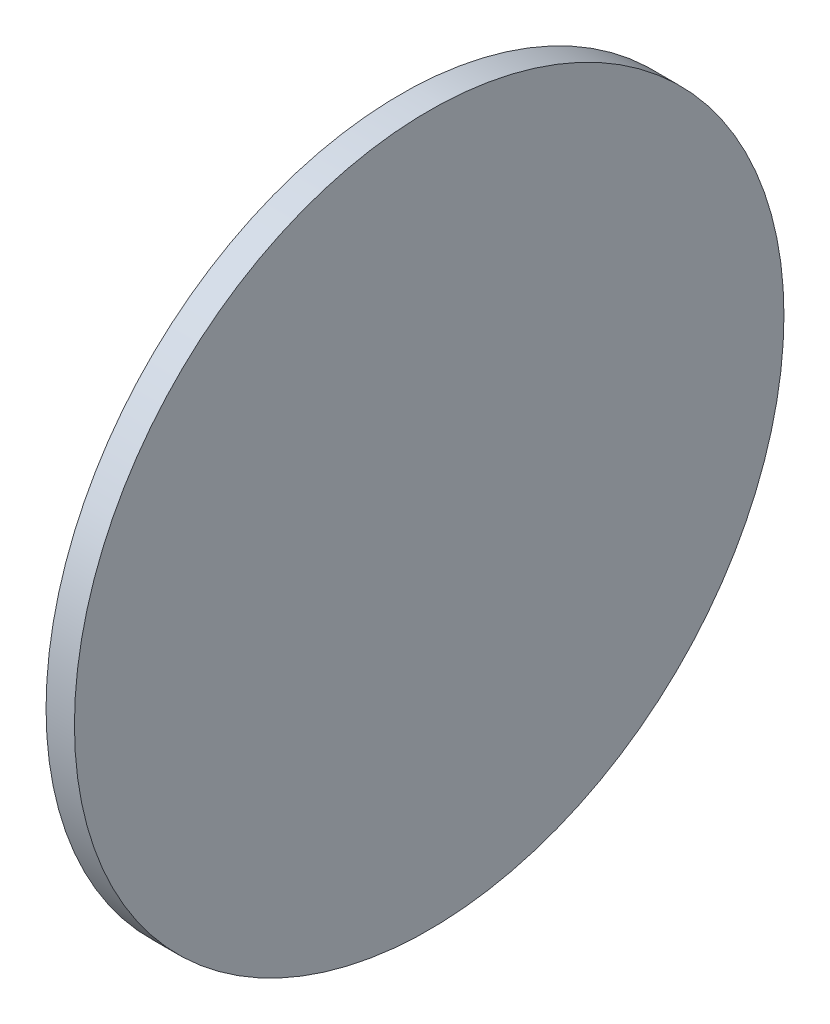
ISO-10303-21;
HEADER;
FILE_DESCRIPTION(('STEP AP214'),'2;1');
FILE_NAME('part.step','',(''),(''),'','','');
FILE_SCHEMA(('AUTOMOTIVE_DESIGN { 1 0 10303 214 1 1 1 1 }'));
ENDSEC;
DATA;
#1=APPLICATION_CONTEXT('core data for automotive mechanical design processes');
#2=APPLICATION_PROTOCOL_DEFINITION('international standard','automotive_design',2000,#1);
#3=PRODUCT_CONTEXT('',#1,'mechanical');
#4=PRODUCT('Part','Part','',(#3));
#5=PRODUCT_RELATED_PRODUCT_CATEGORY('part','',(#4));
#6=PRODUCT_DEFINITION_FORMATION('','',#4);
#7=PRODUCT_DEFINITION_CONTEXT('part definition',#1,'design');
#8=PRODUCT_DEFINITION('design','',#6,#7);
#9=PRODUCT_DEFINITION_SHAPE('','',#8);
#10=(LENGTH_UNIT() NAMED_UNIT(*) SI_UNIT(.MILLI.,.METRE.));
#11=(NAMED_UNIT(*) PLANE_ANGLE_UNIT() SI_UNIT($,.RADIAN.));
#12=(NAMED_UNIT(*) SI_UNIT($,.STERADIAN.) SOLID_ANGLE_UNIT());
#13=UNCERTAINTY_MEASURE_WITH_UNIT(LENGTH_MEASURE(1.E-05),#10,'distance_accuracy_value','');
#14=(GEOMETRIC_REPRESENTATION_CONTEXT(3) GLOBAL_UNCERTAINTY_ASSIGNED_CONTEXT((#13)) GLOBAL_UNIT_ASSIGNED_CONTEXT((#10,
#11,#12)) REPRESENTATION_CONTEXT('',''));
#15=CARTESIAN_POINT('',(0.,0.,0.));
#16=DIRECTION('',(0.,0.,1.));
#17=DIRECTION('',(1.,0.,0.));
#18=AXIS2_PLACEMENT_3D('',#15,#16,#17);
#19=CARTESIAN_POINT('',(0.,0.,0.));
#20=DIRECTION('',(-1.,0.,0.));
#21=DIRECTION('',(0.,0.,1.));
#22=AXIS2_PLACEMENT_3D('',#19,#20,#21);
#23=CYLINDRICAL_SURFACE('',#22,25.);
#24=CARTESIAN_POINT('',(0.,0.,0.));
#25=DIRECTION('',(-1.,0.,0.));
#26=DIRECTION('',(0.,0.,1.));
#27=AXIS2_PLACEMENT_3D('',#24,#25,#26);
#28=CIRCLE('',#27,25.);
#29=CARTESIAN_POINT('',(0.,0.,25.));
#30=VERTEX_POINT('',#29);
#31=EDGE_CURVE('E44',#30,#30,#28,.T.);
#32=ORIENTED_EDGE('',*,*,#31,.F.);
#33=EDGE_LOOP('',(#32));
#34=FACE_BOUND('',#33,.T.);
#35=CARTESIAN_POINT('',(2.,0.,0.));
#36=DIRECTION('',(-1.,0.,0.));
#37=DIRECTION('',(0.,0.,1.));
#38=AXIS2_PLACEMENT_3D('',#35,#36,#37);
#39=CIRCLE('',#38,25.);
#40=CARTESIAN_POINT('',(2.,0.,25.));
#41=VERTEX_POINT('',#40);
#42=EDGE_CURVE('E10',#41,#41,#39,.T.);
#43=ORIENTED_EDGE('',*,*,#42,.T.);
#44=EDGE_LOOP('',(#43));
#45=FACE_BOUND('',#44,.T.);
#46=ADVANCED_FACE('F37',(#34,#45),#23,.T.);
#47=CARTESIAN_POINT('',(2.,25.,0.));
#48=DIRECTION('',(-1.,0.,0.));
#49=DIRECTION('',(0.,0.,1.));
#50=AXIS2_PLACEMENT_3D('',#47,#48,#49);
#51=PLANE('',#50);
#52=ORIENTED_EDGE('',*,*,#42,.F.);
#53=EDGE_LOOP('',(#52));
#54=FACE_BOUND('',#53,.T.);
#55=ADVANCED_FACE('F54',(#54),#51,.F.);
#56=CARTESIAN_POINT('',(0.,25.,0.));
#57=DIRECTION('',(1.,0.,0.));
#58=DIRECTION('',(0.,0.,-1.));
#59=AXIS2_PLACEMENT_3D('',#56,#57,#58);
#60=PLANE('',#59);
#61=ORIENTED_EDGE('',*,*,#31,.T.);
#62=EDGE_LOOP('',(#61));
#63=FACE_BOUND('',#62,.T.);
#64=ADVANCED_FACE('F51',(#63),#60,.F.);
#65=CLOSED_SHELL('',(#46,#55,#64));
#66=MANIFOLD_SOLID_BREP('B2',#65);
#67=ADVANCED_BREP_SHAPE_REPRESENTATION('',(#18,#66),#14);
#68=SHAPE_DEFINITION_REPRESENTATION(#9,#67);
ENDSEC;
END-ISO-10303-21;
